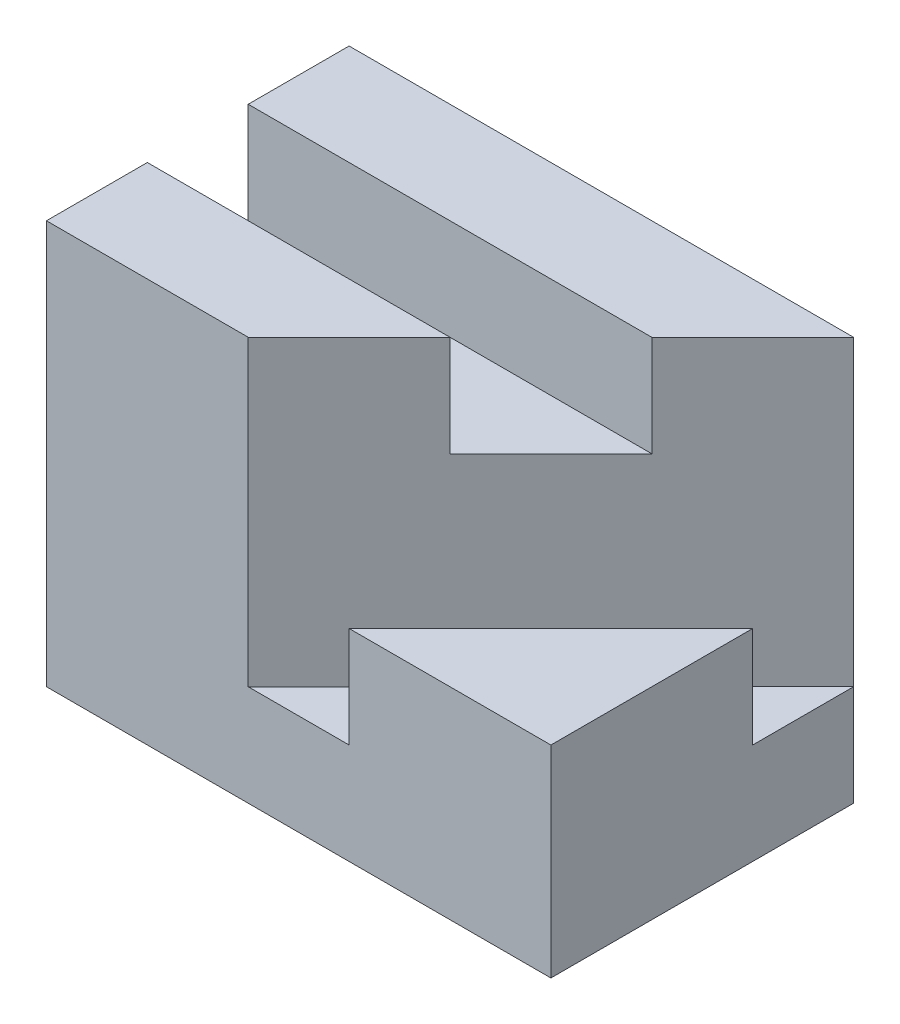
ISO-10303-21;
HEADER;
FILE_DESCRIPTION(('STEP AP214'),'2;1');
FILE_NAME('part.step','',(''),(''),'','','');
FILE_SCHEMA(('AUTOMOTIVE_DESIGN { 1 0 10303 214 1 1 1 1 }'));
ENDSEC;
DATA;
#1=APPLICATION_CONTEXT('core data for automotive mechanical design processes');
#2=APPLICATION_PROTOCOL_DEFINITION('international standard','automotive_design',2000,#1);
#3=PRODUCT_CONTEXT('',#1,'mechanical');
#4=PRODUCT('Part','Part','',(#3));
#5=PRODUCT_RELATED_PRODUCT_CATEGORY('part','',(#4));
#6=PRODUCT_DEFINITION_FORMATION('','',#4);
#7=PRODUCT_DEFINITION_CONTEXT('part definition',#1,'design');
#8=PRODUCT_DEFINITION('design','',#6,#7);
#9=PRODUCT_DEFINITION_SHAPE('','',#8);
#10=(LENGTH_UNIT() NAMED_UNIT(*) SI_UNIT(.MILLI.,.METRE.));
#11=(NAMED_UNIT(*) PLANE_ANGLE_UNIT() SI_UNIT($,.RADIAN.));
#12=(NAMED_UNIT(*) SI_UNIT($,.STERADIAN.) SOLID_ANGLE_UNIT());
#13=UNCERTAINTY_MEASURE_WITH_UNIT(LENGTH_MEASURE(1.E-05),#10,'distance_accuracy_value','');
#14=(GEOMETRIC_REPRESENTATION_CONTEXT(3) GLOBAL_UNCERTAINTY_ASSIGNED_CONTEXT((#13)) GLOBAL_UNIT_ASSIGNED_CONTEXT((#10,
#11,#12)) REPRESENTATION_CONTEXT('',''));
#15=CARTESIAN_POINT('',(0.,0.,0.));
#16=DIRECTION('',(0.,0.,1.));
#17=DIRECTION('',(1.,0.,0.));
#18=AXIS2_PLACEMENT_3D('',#15,#16,#17);
#19=CARTESIAN_POINT('',(12.5,20.,-7.5));
#20=DIRECTION('',(-1.,0.,0.));
#21=DIRECTION('',(0.,0.,1.));
#22=AXIS2_PLACEMENT_3D('',#19,#20,#21);
#23=PLANE('',#22);
#24=DIRECTION('',(0.,0.,-1.));
#25=VECTOR('',#24,1.);
#26=CARTESIAN_POINT('',(12.5,10.,0.));
#27=LINE('',#26,#25);
#28=CARTESIAN_POINT('',(12.5,10.,7.5));
#29=VERTEX_POINT('',#28);
#30=CARTESIAN_POINT('',(12.5,10.,-2.5));
#31=VERTEX_POINT('',#30);
#32=EDGE_CURVE('E48',#29,#31,#27,.T.);
#33=ORIENTED_EDGE('',*,*,#32,.F.);
#34=DIRECTION('',(0.,-1.,0.));
#35=VECTOR('',#34,1.);
#36=CARTESIAN_POINT('',(12.5,20.,7.5));
#37=LINE('',#36,#35);
#38=CARTESIAN_POINT('',(12.5,0.,7.5));
#39=VERTEX_POINT('',#38);
#40=EDGE_CURVE('E131',#29,#39,#37,.T.);
#41=ORIENTED_EDGE('',*,*,#40,.T.);
#42=DIRECTION('',(0.,0.,-1.));
#43=VECTOR('',#42,1.);
#44=CARTESIAN_POINT('',(12.5,0.,-7.5));
#45=LINE('',#44,#43);
#46=CARTESIAN_POINT('',(12.5,0.,-7.5));
#47=VERTEX_POINT('',#46);
#48=EDGE_CURVE('E187',#39,#47,#45,.T.);
#49=ORIENTED_EDGE('',*,*,#48,.T.);
#50=DIRECTION('',(0.,-1.,0.));
#51=VECTOR('',#50,1.);
#52=CARTESIAN_POINT('',(12.5,20.,-7.5));
#53=LINE('',#52,#51);
#54=CARTESIAN_POINT('',(12.5,5.,-7.5));
#55=VERTEX_POINT('',#54);
#56=EDGE_CURVE('E194',#55,#47,#53,.T.);
#57=ORIENTED_EDGE('',*,*,#56,.F.);
#58=DIRECTION('',(0.,0.,-1.));
#59=VECTOR('',#58,1.);
#60=CARTESIAN_POINT('',(12.5,5.,0.));
#61=LINE('',#60,#59);
#62=CARTESIAN_POINT('',(12.5,5.,-2.5));
#63=VERTEX_POINT('',#62);
#64=EDGE_CURVE('E138',#63,#55,#61,.T.);
#65=ORIENTED_EDGE('',*,*,#64,.F.);
#66=DIRECTION('',(0.,1.,0.));
#67=VECTOR('',#66,1.);
#68=CARTESIAN_POINT('',(12.5,5.,-2.5));
#69=LINE('',#68,#67);
#70=EDGE_CURVE('E137',#63,#31,#69,.T.);
#71=ORIENTED_EDGE('',*,*,#70,.T.);
#72=EDGE_LOOP('',(#33,#41,#49,#57,#65,#71));
#73=FACE_BOUND('',#72,.T.);
#74=ADVANCED_FACE('F33',(#73),#23,.F.);
#75=CARTESIAN_POINT('',(12.5,20.,7.5));
#76=DIRECTION('',(0.,0.,-1.));
#77=DIRECTION('',(-1.,0.,0.));
#78=AXIS2_PLACEMENT_3D('',#75,#76,#77);
#79=PLANE('',#78);
#80=DIRECTION('',(1.,0.,0.));
#81=VECTOR('',#80,1.);
#82=CARTESIAN_POINT('',(0.,10.,7.5));
#83=LINE('',#82,#81);
#84=CARTESIAN_POINT('',(2.5,10.,7.5));
#85=VERTEX_POINT('',#84);
#86=EDGE_CURVE('E119',#85,#29,#83,.T.);
#87=ORIENTED_EDGE('',*,*,#86,.F.);
#88=DIRECTION('',(0.,1.,0.));
#89=VECTOR('',#88,1.);
#90=CARTESIAN_POINT('',(2.5,5.,7.5));
#91=LINE('',#90,#89);
#92=CARTESIAN_POINT('',(2.5,5.,7.5));
#93=VERTEX_POINT('',#92);
#94=EDGE_CURVE('E129',#93,#85,#91,.T.);
#95=ORIENTED_EDGE('',*,*,#94,.F.);
#96=DIRECTION('',(1.,0.,0.));
#97=VECTOR('',#96,1.);
#98=CARTESIAN_POINT('',(0.,5.,7.5));
#99=LINE('',#98,#97);
#100=CARTESIAN_POINT('',(-2.5,5.,7.5));
#101=VERTEX_POINT('',#100);
#102=EDGE_CURVE('E215',#101,#93,#99,.T.);
#103=ORIENTED_EDGE('',*,*,#102,.F.);
#104=DIRECTION('',(0.,1.,0.));
#105=VECTOR('',#104,1.);
#106=CARTESIAN_POINT('',(-2.5,15.,7.5));
#107=LINE('',#106,#105);
#108=CARTESIAN_POINT('',(-2.5,20.,7.5));
#109=VERTEX_POINT('',#108);
#110=EDGE_CURVE('E169',#101,#109,#107,.T.);
#111=ORIENTED_EDGE('',*,*,#110,.T.);
#112=DIRECTION('',(1.,0.,0.));
#113=VECTOR('',#112,1.);
#114=CARTESIAN_POINT('',(12.5,20.,7.5));
#115=LINE('',#114,#113);
#116=CARTESIAN_POINT('',(-12.5,20.,7.5));
#117=VERTEX_POINT('',#116);
#118=EDGE_CURVE('E176',#117,#109,#115,.T.);
#119=ORIENTED_EDGE('',*,*,#118,.F.);
#120=DIRECTION('',(0.,-1.,0.));
#121=VECTOR('',#120,1.);
#122=CARTESIAN_POINT('',(-12.5,20.,7.5));
#123=LINE('',#122,#121);
#124=CARTESIAN_POINT('',(-12.5,0.,7.5));
#125=VERTEX_POINT('',#124);
#126=EDGE_CURVE('E41',#117,#125,#123,.T.);
#127=ORIENTED_EDGE('',*,*,#126,.T.);
#128=DIRECTION('',(1.,0.,0.));
#129=VECTOR('',#128,1.);
#130=CARTESIAN_POINT('',(12.5,0.,7.5));
#131=LINE('',#130,#129);
#132=EDGE_CURVE('E185',#125,#39,#131,.T.);
#133=ORIENTED_EDGE('',*,*,#132,.T.);
#134=ORIENTED_EDGE('',*,*,#40,.F.);
#135=EDGE_LOOP('',(#87,#95,#103,#111,#119,#127,#133,#134));
#136=FACE_BOUND('',#135,.T.);
#137=ADVANCED_FACE('F127',(#136),#79,.F.);
#138=CARTESIAN_POINT('',(5.,5.,5.));
#139=DIRECTION('',(0.707106781186548,0.,0.707106781186547));
#140=DIRECTION('',(0.707106781186547,0.,-0.707106781186548));
#141=AXIS2_PLACEMENT_3D('',#138,#139,#140);
#142=PLANE('',#141);
#143=DIRECTION('',(0.707106781186547,0.,-0.707106781186548));
#144=VECTOR('',#143,1.);
#145=CARTESIAN_POINT('',(5.,10.,5.));
#146=LINE('',#145,#144);
#147=EDGE_CURVE('E116',#85,#31,#146,.T.);
#148=ORIENTED_EDGE('',*,*,#147,.T.);
#149=ORIENTED_EDGE('',*,*,#70,.F.);
#150=DIRECTION('',(0.707106781186547,0.,-0.707106781186548));
#151=VECTOR('',#150,1.);
#152=CARTESIAN_POINT('',(5.,5.,5.));
#153=LINE('',#152,#151);
#154=EDGE_CURVE('E135',#93,#63,#153,.T.);
#155=ORIENTED_EDGE('',*,*,#154,.F.);
#156=ORIENTED_EDGE('',*,*,#94,.T.);
#157=EDGE_LOOP('',(#148,#149,#155,#156));
#158=FACE_BOUND('',#157,.T.);
#159=ADVANCED_FACE('F133',(#158),#142,.F.);
#160=CARTESIAN_POINT('',(0.,15.,0.));
#161=DIRECTION('',(0.,1.,0.));
#162=DIRECTION('',(0.,0.,1.));
#163=AXIS2_PLACEMENT_3D('',#160,#161,#162);
#164=PLANE('',#163);
#165=DIRECTION('',(-0.707106781186547,0.,0.707106781186548));
#166=VECTOR('',#165,1.);
#167=CARTESIAN_POINT('',(2.5,15.,2.5));
#168=LINE('',#167,#166);
#169=CARTESIAN_POINT('',(7.5,15.,-2.5));
#170=VERTEX_POINT('',#169);
#171=CARTESIAN_POINT('',(2.5,15.,2.5));
#172=VERTEX_POINT('',#171);
#173=EDGE_CURVE('E11',#170,#172,#168,.T.);
#174=ORIENTED_EDGE('',*,*,#173,.F.);
#175=DIRECTION('',(1.,0.,0.));
#176=VECTOR('',#175,1.);
#177=CARTESIAN_POINT('',(0.,15.,-2.5));
#178=LINE('',#177,#176);
#179=CARTESIAN_POINT('',(-12.5,15.,-2.5));
#180=VERTEX_POINT('',#179);
#181=EDGE_CURVE('E147',#180,#170,#178,.T.);
#182=ORIENTED_EDGE('',*,*,#181,.F.);
#183=DIRECTION('',(0.,0.,1.));
#184=VECTOR('',#183,1.);
#185=CARTESIAN_POINT('',(-12.5,15.,0.));
#186=LINE('',#185,#184);
#187=CARTESIAN_POINT('',(-12.5,15.,2.5));
#188=VERTEX_POINT('',#187);
#189=EDGE_CURVE('E151',#180,#188,#186,.T.);
#190=ORIENTED_EDGE('',*,*,#189,.T.);
#191=DIRECTION('',(1.,0.,0.));
#192=VECTOR('',#191,1.);
#193=CARTESIAN_POINT('',(0.,15.,2.5));
#194=LINE('',#193,#192);
#195=EDGE_CURVE('E144',#188,#172,#194,.T.);
#196=ORIENTED_EDGE('',*,*,#195,.T.);
#197=EDGE_LOOP('',(#174,#182,#190,#196));
#198=FACE_BOUND('',#197,.T.);
#199=ADVANCED_FACE('F231',(#198),#164,.T.);
#200=CARTESIAN_POINT('',(0.,20.,0.));
#201=DIRECTION('',(0.,-1.,0.));
#202=DIRECTION('',(0.,0.,-1.));
#203=AXIS2_PLACEMENT_3D('',#200,#201,#202);
#204=PLANE('',#203);
#205=DIRECTION('',(1.,0.,0.));
#206=VECTOR('',#205,1.);
#207=CARTESIAN_POINT('',(0.,20.,-2.5));
#208=LINE('',#207,#206);
#209=CARTESIAN_POINT('',(-12.5,20.,-2.5));
#210=VERTEX_POINT('',#209);
#211=CARTESIAN_POINT('',(7.5,20.,-2.5));
#212=VERTEX_POINT('',#211);
#213=EDGE_CURVE('E148',#210,#212,#208,.T.);
#214=ORIENTED_EDGE('',*,*,#213,.T.);
#215=DIRECTION('',(-0.707106781186547,0.,0.707106781186548));
#216=VECTOR('',#215,1.);
#217=CARTESIAN_POINT('',(2.5,20.,2.5));
#218=LINE('',#217,#216);
#219=CARTESIAN_POINT('',(12.5,20.,-7.5));
#220=VERTEX_POINT('',#219);
#221=EDGE_CURVE('E158',#220,#212,#218,.T.);
#222=ORIENTED_EDGE('',*,*,#221,.F.);
#223=DIRECTION('',(-1.,0.,0.));
#224=VECTOR('',#223,1.);
#225=CARTESIAN_POINT('',(12.5,20.,-7.5));
#226=LINE('',#225,#224);
#227=CARTESIAN_POINT('',(-12.5,20.,-7.5));
#228=VERTEX_POINT('',#227);
#229=EDGE_CURVE('E180',#220,#228,#226,.T.);
#230=ORIENTED_EDGE('',*,*,#229,.T.);
#231=DIRECTION('',(0.,0.,1.));
#232=VECTOR('',#231,1.);
#233=CARTESIAN_POINT('',(-12.5,20.,-7.5));
#234=LINE('',#233,#232);
#235=EDGE_CURVE('E173',#228,#210,#234,.T.);
#236=ORIENTED_EDGE('',*,*,#235,.T.);
#237=EDGE_LOOP('',(#214,#222,#230,#236));
#238=FACE_BOUND('',#237,.T.);
#239=ADVANCED_FACE('F240',(#238),#204,.F.);
#240=CARTESIAN_POINT('',(-12.5,20.,-7.5));
#241=DIRECTION('',(1.,0.,0.));
#242=DIRECTION('',(0.,0.,-1.));
#243=AXIS2_PLACEMENT_3D('',#240,#241,#242);
#244=PLANE('',#243);
#245=CARTESIAN_POINT('',(-12.5,20.,2.5));
#246=VERTEX_POINT('',#245);
#247=EDGE_CURVE('E177',#246,#117,#234,.T.);
#248=ORIENTED_EDGE('',*,*,#247,.F.);
#249=DIRECTION('',(0.,1.,0.));
#250=VECTOR('',#249,1.);
#251=CARTESIAN_POINT('',(-12.5,15.,2.5));
#252=LINE('',#251,#250);
#253=EDGE_CURVE('E161',#188,#246,#252,.T.);
#254=ORIENTED_EDGE('',*,*,#253,.F.);
#255=ORIENTED_EDGE('',*,*,#189,.F.);
#256=DIRECTION('',(0.,1.,0.));
#257=VECTOR('',#256,1.);
#258=CARTESIAN_POINT('',(-12.5,15.,-2.5));
#259=LINE('',#258,#257);
#260=EDGE_CURVE('E164',#180,#210,#259,.T.);
#261=ORIENTED_EDGE('',*,*,#260,.T.);
#262=ORIENTED_EDGE('',*,*,#235,.F.);
#263=DIRECTION('',(0.,-1.,0.));
#264=VECTOR('',#263,1.);
#265=CARTESIAN_POINT('',(-12.5,20.,-7.5));
#266=LINE('',#265,#264);
#267=CARTESIAN_POINT('',(-12.5,0.,-7.5));
#268=VERTEX_POINT('',#267);
#269=EDGE_CURVE('E182',#228,#268,#266,.T.);
#270=ORIENTED_EDGE('',*,*,#269,.T.);
#271=DIRECTION('',(0.,0.,1.));
#272=VECTOR('',#271,1.);
#273=CARTESIAN_POINT('',(-12.5,0.,-7.5));
#274=LINE('',#273,#272);
#275=EDGE_CURVE('E163',#268,#125,#274,.T.);
#276=ORIENTED_EDGE('',*,*,#275,.T.);
#277=ORIENTED_EDGE('',*,*,#126,.F.);
#278=EDGE_LOOP('',(#248,#254,#255,#261,#262,#270,#276,#277));
#279=FACE_BOUND('',#278,.T.);
#280=ADVANCED_FACE('F35',(#279),#244,.F.);
#281=CARTESIAN_POINT('',(12.5,20.,-7.5));
#282=DIRECTION('',(0.,0.,1.));
#283=DIRECTION('',(1.,0.,0.));
#284=AXIS2_PLACEMENT_3D('',#281,#282,#283);
#285=PLANE('',#284);
#286=DIRECTION('',(-1.,0.,0.));
#287=VECTOR('',#286,1.);
#288=CARTESIAN_POINT('',(12.5,0.,-7.5));
#289=LINE('',#288,#287);
#290=EDGE_CURVE('E190',#47,#268,#289,.T.);
#291=ORIENTED_EDGE('',*,*,#290,.T.);
#292=ORIENTED_EDGE('',*,*,#269,.F.);
#293=ORIENTED_EDGE('',*,*,#229,.F.);
#294=EDGE_CURVE('E195',#220,#55,#53,.T.);
#295=ORIENTED_EDGE('',*,*,#294,.T.);
#296=ORIENTED_EDGE('',*,*,#56,.T.);
#297=EDGE_LOOP('',(#291,#292,#293,#295,#296));
#298=FACE_BOUND('',#297,.T.);
#299=ADVANCED_FACE('F242',(#298),#285,.F.);
#300=CARTESIAN_POINT('',(2.5,20.,2.5));
#301=VERTEX_POINT('',#300);
#302=EDGE_CURVE('E156',#301,#109,#218,.T.);
#303=ORIENTED_EDGE('',*,*,#302,.F.);
#304=DIRECTION('',(1.,0.,0.));
#305=VECTOR('',#304,1.);
#306=CARTESIAN_POINT('',(0.,20.,2.5));
#307=LINE('',#306,#305);
#308=EDGE_CURVE('E56',#246,#301,#307,.T.);
#309=ORIENTED_EDGE('',*,*,#308,.F.);
#310=ORIENTED_EDGE('',*,*,#247,.T.);
#311=ORIENTED_EDGE('',*,*,#118,.T.);
#312=EDGE_LOOP('',(#303,#309,#310,#311));
#313=FACE_BOUND('',#312,.T.);
#314=ADVANCED_FACE('F225',(#313),#204,.F.);
#315=CARTESIAN_POINT('',(0.,0.,0.));
#316=DIRECTION('',(0.,-1.,0.));
#317=DIRECTION('',(0.,0.,-1.));
#318=AXIS2_PLACEMENT_3D('',#315,#316,#317);
#319=PLANE('',#318);
#320=ORIENTED_EDGE('',*,*,#275,.F.);
#321=ORIENTED_EDGE('',*,*,#290,.F.);
#322=ORIENTED_EDGE('',*,*,#48,.F.);
#323=ORIENTED_EDGE('',*,*,#132,.F.);
#324=EDGE_LOOP('',(#320,#321,#322,#323));
#325=FACE_BOUND('',#324,.T.);
#326=ADVANCED_FACE('F208',(#325),#319,.T.);
#327=CARTESIAN_POINT('',(0.,15.,2.5));
#328=DIRECTION('',(0.,0.,1.));
#329=DIRECTION('',(1.,0.,0.));
#330=AXIS2_PLACEMENT_3D('',#327,#328,#329);
#331=PLANE('',#330);
#332=ORIENTED_EDGE('',*,*,#308,.T.);
#333=DIRECTION('',(0.,1.,0.));
#334=VECTOR('',#333,1.);
#335=CARTESIAN_POINT('',(2.5,15.,2.5));
#336=LINE('',#335,#334);
#337=EDGE_CURVE('E154',#172,#301,#336,.T.);
#338=ORIENTED_EDGE('',*,*,#337,.F.);
#339=ORIENTED_EDGE('',*,*,#195,.F.);
#340=ORIENTED_EDGE('',*,*,#253,.T.);
#341=EDGE_LOOP('',(#332,#338,#339,#340));
#342=FACE_BOUND('',#341,.T.);
#343=ADVANCED_FACE('F228',(#342),#331,.F.);
#344=CARTESIAN_POINT('',(0.,15.,-2.5));
#345=DIRECTION('',(0.,0.,1.));
#346=DIRECTION('',(1.,0.,0.));
#347=AXIS2_PLACEMENT_3D('',#344,#345,#346);
#348=PLANE('',#347);
#349=ORIENTED_EDGE('',*,*,#213,.F.);
#350=ORIENTED_EDGE('',*,*,#260,.F.);
#351=ORIENTED_EDGE('',*,*,#181,.T.);
#352=DIRECTION('',(0.,1.,0.));
#353=VECTOR('',#352,1.);
#354=CARTESIAN_POINT('',(7.5,15.,-2.5));
#355=LINE('',#354,#353);
#356=EDGE_CURVE('E167',#170,#212,#355,.T.);
#357=ORIENTED_EDGE('',*,*,#356,.T.);
#358=EDGE_LOOP('',(#349,#350,#351,#357));
#359=FACE_BOUND('',#358,.T.);
#360=ADVANCED_FACE('F234',(#359),#348,.T.);
#361=CARTESIAN_POINT('',(2.5,15.,2.5));
#362=DIRECTION('',(-0.707106781186548,0.,-0.707106781186547));
#363=DIRECTION('',(-0.707106781186547,0.,0.707106781186548));
#364=AXIS2_PLACEMENT_3D('',#361,#362,#363);
#365=PLANE('',#364);
#366=ORIENTED_EDGE('',*,*,#221,.T.);
#367=ORIENTED_EDGE('',*,*,#356,.F.);
#368=ORIENTED_EDGE('',*,*,#173,.T.);
#369=ORIENTED_EDGE('',*,*,#337,.T.);
#370=ORIENTED_EDGE('',*,*,#302,.T.);
#371=ORIENTED_EDGE('',*,*,#110,.F.);
#372=DIRECTION('',(-0.707106781186547,0.,0.707106781186548));
#373=VECTOR('',#372,1.);
#374=CARTESIAN_POINT('',(2.5,5.,2.5));
#375=LINE('',#374,#373);
#376=EDGE_CURVE('E212',#55,#101,#375,.T.);
#377=ORIENTED_EDGE('',*,*,#376,.F.);
#378=ORIENTED_EDGE('',*,*,#294,.F.);
#379=EDGE_LOOP('',(#366,#367,#368,#369,#370,#371,#377,#378));
#380=FACE_BOUND('',#379,.T.);
#381=ADVANCED_FACE('F236',(#380),#365,.F.);
#382=CARTESIAN_POINT('',(0.,5.,0.));
#383=DIRECTION('',(0.,1.,0.));
#384=DIRECTION('',(0.,0.,1.));
#385=AXIS2_PLACEMENT_3D('',#382,#383,#384);
#386=PLANE('',#385);
#387=ORIENTED_EDGE('',*,*,#376,.T.);
#388=ORIENTED_EDGE('',*,*,#102,.T.);
#389=ORIENTED_EDGE('',*,*,#154,.T.);
#390=ORIENTED_EDGE('',*,*,#64,.T.);
#391=EDGE_LOOP('',(#387,#388,#389,#390));
#392=FACE_BOUND('',#391,.T.);
#393=ADVANCED_FACE('F220',(#392),#386,.T.);
#394=CARTESIAN_POINT('',(0.,10.,0.));
#395=DIRECTION('',(0.,1.,0.));
#396=DIRECTION('',(0.,0.,1.));
#397=AXIS2_PLACEMENT_3D('',#394,#395,#396);
#398=PLANE('',#397);
#399=ORIENTED_EDGE('',*,*,#147,.F.);
#400=ORIENTED_EDGE('',*,*,#86,.T.);
#401=ORIENTED_EDGE('',*,*,#32,.T.);
#402=EDGE_LOOP('',(#399,#400,#401));
#403=FACE_BOUND('',#402,.T.);
#404=ADVANCED_FACE('F118',(#403),#398,.T.);
#405=CLOSED_SHELL('',(#74,#137,#159,#199,#239,#280,#299,#314,#326,#343,#360,#381,#393,#404));
#406=MANIFOLD_SOLID_BREP('B2',#405);
#407=ADVANCED_BREP_SHAPE_REPRESENTATION('',(#18,#406),#14);
#408=SHAPE_DEFINITION_REPRESENTATION(#9,#407);
ENDSEC;
END-ISO-10303-21;
